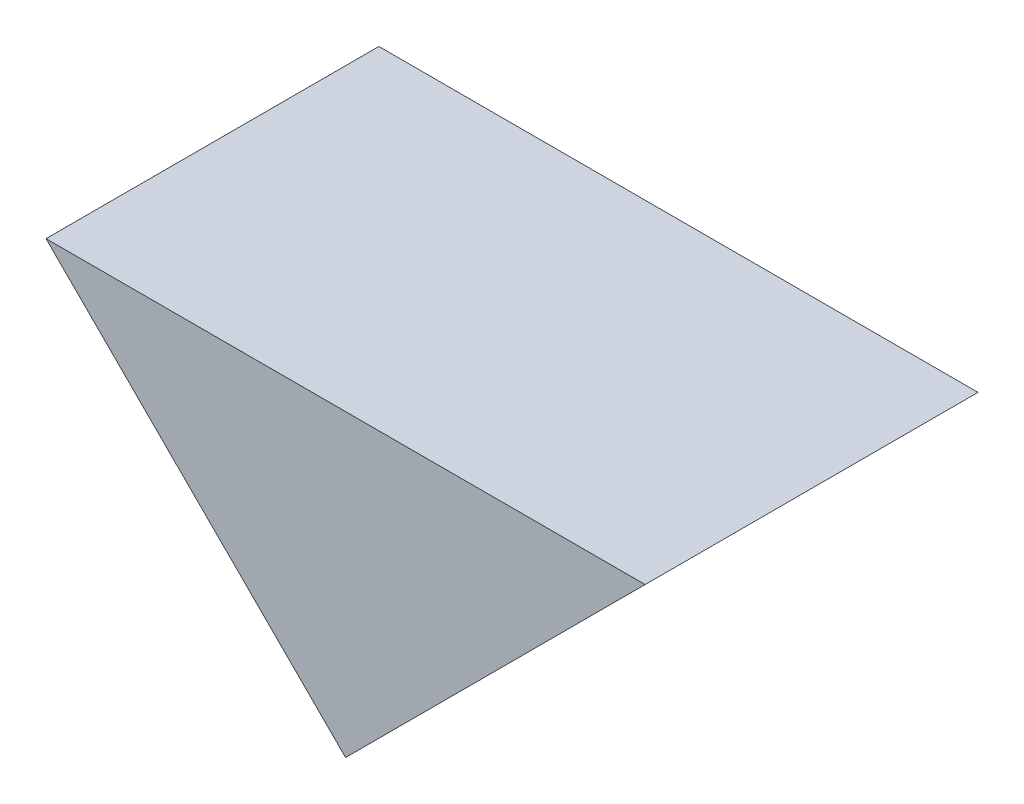
ISO-10303-21;
HEADER;
FILE_DESCRIPTION(('STEP AP214'),'2;1');
FILE_NAME('part.step','',(''),(''),'','','');
FILE_SCHEMA(('AUTOMOTIVE_DESIGN { 1 0 10303 214 1 1 1 1 }'));
ENDSEC;
DATA;
#1=APPLICATION_CONTEXT('core data for automotive mechanical design processes');
#2=APPLICATION_PROTOCOL_DEFINITION('international standard','automotive_design',2000,#1);
#3=PRODUCT_CONTEXT('',#1,'mechanical');
#4=PRODUCT('Part','Part','',(#3));
#5=PRODUCT_RELATED_PRODUCT_CATEGORY('part','',(#4));
#6=PRODUCT_DEFINITION_FORMATION('','',#4);
#7=PRODUCT_DEFINITION_CONTEXT('part definition',#1,'design');
#8=PRODUCT_DEFINITION('design','',#6,#7);
#9=PRODUCT_DEFINITION_SHAPE('','',#8);
#10=(LENGTH_UNIT() NAMED_UNIT(*) SI_UNIT(.MILLI.,.METRE.));
#11=(NAMED_UNIT(*) PLANE_ANGLE_UNIT() SI_UNIT($,.RADIAN.));
#12=(NAMED_UNIT(*) SI_UNIT($,.STERADIAN.) SOLID_ANGLE_UNIT());
#13=UNCERTAINTY_MEASURE_WITH_UNIT(LENGTH_MEASURE(1.E-05),#10,'distance_accuracy_value','');
#14=(GEOMETRIC_REPRESENTATION_CONTEXT(3) GLOBAL_UNCERTAINTY_ASSIGNED_CONTEXT((#13)) GLOBAL_UNIT_ASSIGNED_CONTEXT((#10,
#11,#12)) REPRESENTATION_CONTEXT('',''));
#15=CARTESIAN_POINT('',(0.,0.,0.));
#16=DIRECTION('',(0.,0.,1.));
#17=DIRECTION('',(1.,0.,0.));
#18=AXIS2_PLACEMENT_3D('',#15,#16,#17);
#19=CARTESIAN_POINT('',(-12.9089698634811,-9.93152885591314,-15.595600000003));
#20=DIRECTION('',(0.707106781186547,0.707106781186548,0.));
#21=DIRECTION('',(-0.707106781186548,0.707106781186547,0.));
#22=AXIS2_PLACEMENT_3D('',#19,#20,#21);
#23=PLANE('',#22);
#24=DIRECTION('',(0.,0.,1.));
#25=VECTOR('',#24,1.);
#26=CARTESIAN_POINT('',(-6.79263073452848,-16.0478679848659,-16.2306000000013));
#27=LINE('',#26,#25);
#28=CARTESIAN_POINT('',(-6.79263073452844,-16.0478679848659,-14.9606000000016));
#29=VERTEX_POINT('',#28);
#30=CARTESIAN_POINT('',(-6.79263073452844,-16.0478679848659,-16.2306000000023));
#31=VERTEX_POINT('',#30);
#32=EDGE_CURVE('E52',#29,#31,#27,.F.);
#33=ORIENTED_EDGE('',*,*,#32,.T.);
#34=DIRECTION('',(-0.707106781186616,0.707106781186479,0.));
#35=VECTOR('',#34,1.);
#36=CARTESIAN_POINT('',(-5.64963073452866,-17.1908679848655,-16.2306000000026));
#37=LINE('',#36,#35);
#38=CARTESIAN_POINT('',(-5.64963073452866,-17.1908679848655,-16.2306000000023));
#39=VERTEX_POINT('',#38);
#40=EDGE_CURVE('E20',#39,#31,#37,.T.);
#41=ORIENTED_EDGE('',*,*,#40,.F.);
#42=DIRECTION('',(0.,0.,1.));
#43=VECTOR('',#42,1.);
#44=CARTESIAN_POINT('',(-5.64963073452865,-17.1908679848655,-15.5956000000031));
#45=LINE('',#44,#43);
#46=CARTESIAN_POINT('',(-5.64963073452866,-17.1908679848655,-14.9606000000021));
#47=VERTEX_POINT('',#46);
#48=EDGE_CURVE('E50',#39,#47,#45,.T.);
#49=ORIENTED_EDGE('',*,*,#48,.T.);
#50=DIRECTION('',(-0.707106781186616,0.707106781186479,0.));
#51=VECTOR('',#50,1.);
#52=CARTESIAN_POINT('',(-5.64963073452866,-17.1908679848655,-14.9606000000024));
#53=LINE('',#52,#51);
#54=EDGE_CURVE('E67',#47,#29,#53,.T.);
#55=ORIENTED_EDGE('',*,*,#54,.T.);
#56=EDGE_LOOP('',(#33,#41,#49,#55));
#57=FACE_BOUND('',#56,.T.);
#58=ADVANCED_FACE('F17',(#57),#23,.F.);
#59=CARTESIAN_POINT('',(-2.66453525910038E-13,2.06621600756764,-16.2306000000026));
#60=DIRECTION('',(0.,0.,-1.));
#61=DIRECTION('',(-1.,0.,0.));
#62=AXIS2_PLACEMENT_3D('',#59,#60,#61);
#63=PLANE('',#62);
#64=DIRECTION('',(1.,0.,0.));
#65=VECTOR('',#64,1.);
#66=CARTESIAN_POINT('',(-4.50663073452848,-16.0478679848659,-16.2306000000013));
#67=LINE('',#66,#65);
#68=CARTESIAN_POINT('',(-4.50663073452855,-16.0478679848658,-16.2306000000019));
#69=VERTEX_POINT('',#68);
#70=EDGE_CURVE('E64',#31,#69,#67,.T.);
#71=ORIENTED_EDGE('',*,*,#70,.T.);
#72=DIRECTION('',(-0.707106781186548,-0.707106781186548,0.));
#73=VECTOR('',#72,1.);
#74=CARTESIAN_POINT('',(6.80372662895213,-4.73751062138474,-16.2306000000013));
#75=LINE('',#74,#73);
#76=EDGE_CURVE('E57',#69,#39,#75,.T.);
#77=ORIENTED_EDGE('',*,*,#76,.T.);
#78=ORIENTED_EDGE('',*,*,#40,.T.);
#79=EDGE_LOOP('',(#71,#77,#78));
#80=FACE_BOUND('',#79,.T.);
#81=ADVANCED_FACE('F63',(#80),#63,.T.);
#82=CARTESIAN_POINT('',(6.80372662895213,-4.73751062138474,-15.5956000000031));
#83=DIRECTION('',(-0.707106781186548,0.707106781186548,0.));
#84=DIRECTION('',(-0.707106781186548,-0.707106781186548,0.));
#85=AXIS2_PLACEMENT_3D('',#82,#83,#84);
#86=PLANE('',#85);
#87=ORIENTED_EDGE('',*,*,#76,.F.);
#88=DIRECTION('',(0.,0.,1.));
#89=VECTOR('',#88,1.);
#90=CARTESIAN_POINT('',(-4.50663073452848,-16.0478679848659,-16.2306000000013));
#91=LINE('',#90,#89);
#92=CARTESIAN_POINT('',(-4.50663073452862,-16.0478679848658,-14.9606000000021));
#93=VERTEX_POINT('',#92);
#94=EDGE_CURVE('E26',#69,#93,#91,.T.);
#95=ORIENTED_EDGE('',*,*,#94,.T.);
#96=DIRECTION('',(-0.707106781186727,-0.707106781186368,0.));
#97=VECTOR('',#96,1.);
#98=CARTESIAN_POINT('',(-4.50663073452848,-16.0478679848659,-14.9606000000024));
#99=LINE('',#98,#97);
#100=EDGE_CURVE('E34',#93,#47,#99,.T.);
#101=ORIENTED_EDGE('',*,*,#100,.T.);
#102=ORIENTED_EDGE('',*,*,#48,.F.);
#103=EDGE_LOOP('',(#87,#95,#101,#102));
#104=FACE_BOUND('',#103,.T.);
#105=ADVANCED_FACE('F59',(#104),#86,.F.);
#106=CARTESIAN_POINT('',(-3.73034936274053E-13,8.34887714518118E-13,-14.9606000000024));
#107=DIRECTION('',(0.,0.,-1.));
#108=DIRECTION('',(-1.,0.,0.));
#109=AXIS2_PLACEMENT_3D('',#106,#107,#108);
#110=PLANE('',#109);
#111=ORIENTED_EDGE('',*,*,#100,.F.);
#112=DIRECTION('',(1.,0.,0.));
#113=VECTOR('',#112,1.);
#114=CARTESIAN_POINT('',(-4.50663073452848,-16.0478679848659,-14.9606000000013));
#115=LINE('',#114,#113);
#116=EDGE_CURVE('E11',#93,#29,#115,.F.);
#117=ORIENTED_EDGE('',*,*,#116,.T.);
#118=ORIENTED_EDGE('',*,*,#54,.F.);
#119=EDGE_LOOP('',(#111,#117,#118));
#120=FACE_BOUND('',#119,.T.);
#121=ADVANCED_FACE('F73',(#120),#110,.F.);
#122=CARTESIAN_POINT('',(-4.50663073452848,-16.0478679848659,-16.2306000000013));
#123=DIRECTION('',(0.,-1.,0.));
#124=DIRECTION('',(1.,0.,0.));
#125=AXIS2_PLACEMENT_3D('',#122,#123,#124);
#126=PLANE('',#125);
#127=ORIENTED_EDGE('',*,*,#94,.F.);
#128=ORIENTED_EDGE('',*,*,#70,.F.);
#129=ORIENTED_EDGE('',*,*,#32,.F.);
#130=ORIENTED_EDGE('',*,*,#116,.F.);
#131=EDGE_LOOP('',(#127,#128,#129,#130));
#132=FACE_BOUND('',#131,.T.);
#133=ADVANCED_FACE('F72',(#132),#126,.F.);
#134=CLOSED_SHELL('',(#58,#81,#105,#121,#133));
#135=MANIFOLD_SOLID_BREP('B1',#134);
#136=ADVANCED_BREP_SHAPE_REPRESENTATION('',(#18,#135),#14);
#137=SHAPE_DEFINITION_REPRESENTATION(#9,#136);
ENDSEC;
END-ISO-10303-21;
